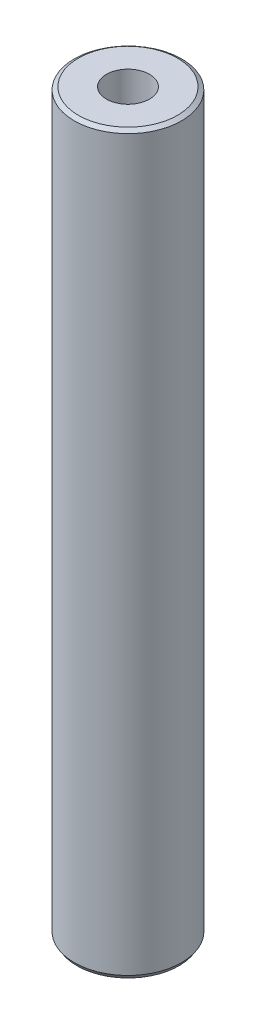
ISO-10303-21;
HEADER;
FILE_DESCRIPTION(('STEP AP214'),'2;1');
FILE_NAME('part.step','',(''),(''),'','','');
FILE_SCHEMA(('AUTOMOTIVE_DESIGN { 1 0 10303 214 1 1 1 1 }'));
ENDSEC;
DATA;
#1=APPLICATION_CONTEXT('core data for automotive mechanical design processes');
#2=APPLICATION_PROTOCOL_DEFINITION('international standard','automotive_design',2000,#1);
#3=PRODUCT_CONTEXT('',#1,'mechanical');
#4=PRODUCT('Part','Part','',(#3));
#5=PRODUCT_RELATED_PRODUCT_CATEGORY('part','',(#4));
#6=PRODUCT_DEFINITION_FORMATION('','',#4);
#7=PRODUCT_DEFINITION_CONTEXT('part definition',#1,'design');
#8=PRODUCT_DEFINITION('design','',#6,#7);
#9=PRODUCT_DEFINITION_SHAPE('','',#8);
#10=(LENGTH_UNIT() NAMED_UNIT(*) SI_UNIT(.MILLI.,.METRE.));
#11=(NAMED_UNIT(*) PLANE_ANGLE_UNIT() SI_UNIT($,.RADIAN.));
#12=(NAMED_UNIT(*) SI_UNIT($,.STERADIAN.) SOLID_ANGLE_UNIT());
#13=UNCERTAINTY_MEASURE_WITH_UNIT(LENGTH_MEASURE(1.E-05),#10,'distance_accuracy_value','');
#14=(GEOMETRIC_REPRESENTATION_CONTEXT(3) GLOBAL_UNCERTAINTY_ASSIGNED_CONTEXT((#13)) GLOBAL_UNIT_ASSIGNED_CONTEXT((#10,
#11,#12)) REPRESENTATION_CONTEXT('',''));
#15=CARTESIAN_POINT('',(0.,0.,0.));
#16=DIRECTION('',(0.,0.,1.));
#17=DIRECTION('',(1.,0.,0.));
#18=AXIS2_PLACEMENT_3D('',#15,#16,#17);
#19=CARTESIAN_POINT('',(0.,548.262568205207,0.));
#20=DIRECTION('',(0.,-1.,0.));
#21=DIRECTION('',(0.,0.,-1.));
#22=AXIS2_PLACEMENT_3D('',#19,#20,#21);
#23=CYLINDRICAL_SURFACE('',#22,40.);
#24=CARTESIAN_POINT('',(0.,546.249589709575,0.));
#25=DIRECTION('',(0.,1.,0.));
#26=DIRECTION('',(0.,0.,1.));
#27=AXIS2_PLACEMENT_3D('',#24,#25,#26);
#28=CIRCLE('',#27,40.);
#29=CARTESIAN_POINT('',(0.,546.249589709575,40.));
#30=VERTEX_POINT('',#29);
#31=EDGE_CURVE('E50',#30,#30,#28,.F.);
#32=ORIENTED_EDGE('',*,*,#31,.T.);
#33=EDGE_LOOP('',(#32));
#34=FACE_BOUND('',#33,.T.);
#35=CARTESIAN_POINT('',(0.,3.06563132807924,0.));
#36=DIRECTION('',(0.,1.,0.));
#37=DIRECTION('',(0.,0.,1.));
#38=AXIS2_PLACEMENT_3D('',#35,#36,#37);
#39=CIRCLE('',#38,40.);
#40=CARTESIAN_POINT('',(0.,3.06563132807924,40.));
#41=VERTEX_POINT('',#40);
#42=EDGE_CURVE('E51',#41,#41,#39,.T.);
#43=ORIENTED_EDGE('',*,*,#42,.T.);
#44=EDGE_LOOP('',(#43));
#45=FACE_BOUND('',#44,.T.);
#46=ADVANCED_FACE('F39',(#34,#45),#23,.T.);
#47=CARTESIAN_POINT('',(0.,548.262568205207,0.));
#48=DIRECTION('',(0.,1.,0.));
#49=DIRECTION('',(0.,0.,1.));
#50=AXIS2_PLACEMENT_3D('',#47,#48,#49);
#51=PLANE('',#50);
#52=CARTESIAN_POINT('',(0.,548.262568205207,0.));
#53=DIRECTION('',(0.,1.,0.));
#54=DIRECTION('',(0.,0.,1.));
#55=AXIS2_PLACEMENT_3D('',#52,#53,#54);
#56=CIRCLE('',#55,36.9343686719209);
#57=CARTESIAN_POINT('',(0.,548.262568205207,36.9343686719209));
#58=VERTEX_POINT('',#57);
#59=EDGE_CURVE('E54',#58,#58,#56,.T.);
#60=ORIENTED_EDGE('',*,*,#59,.T.);
#61=EDGE_LOOP('',(#60));
#62=FACE_BOUND('',#61,.T.);
#63=CARTESIAN_POINT('',(0.,548.262568205207,0.));
#64=DIRECTION('',(0.,1.,0.));
#65=DIRECTION('',(0.,0.,1.));
#66=AXIS2_PLACEMENT_3D('',#63,#64,#65);
#67=CIRCLE('',#66,16.0517247092455);
#68=CARTESIAN_POINT('',(0.,548.262568205207,16.0517247092455));
#69=VERTEX_POINT('',#68);
#70=EDGE_CURVE('E58',#69,#69,#67,.T.);
#71=ORIENTED_EDGE('',*,*,#70,.F.);
#72=EDGE_LOOP('',(#71));
#73=FACE_BOUND('',#72,.T.);
#74=ADVANCED_FACE('F69',(#62,#73),#51,.T.);
#75=CARTESIAN_POINT('',(0.,0.,0.));
#76=DIRECTION('',(0.,1.,0.));
#77=DIRECTION('',(0.,0.,1.));
#78=AXIS2_PLACEMENT_3D('',#75,#76,#77);
#79=PLANE('',#78);
#80=CARTESIAN_POINT('',(0.,0.,0.));
#81=DIRECTION('',(0.,1.,0.));
#82=DIRECTION('',(0.,0.,1.));
#83=AXIS2_PLACEMENT_3D('',#80,#81,#82);
#84=CIRCLE('',#83,37.9870215043677);
#85=CARTESIAN_POINT('',(0.,0.,37.9870215043677));
#86=VERTEX_POINT('',#85);
#87=EDGE_CURVE('E10',#86,#86,#84,.F.);
#88=ORIENTED_EDGE('',*,*,#87,.T.);
#89=EDGE_LOOP('',(#88));
#90=FACE_BOUND('',#89,.T.);
#91=CARTESIAN_POINT('',(0.,0.,0.));
#92=DIRECTION('',(0.,1.,0.));
#93=DIRECTION('',(0.,0.,1.));
#94=AXIS2_PLACEMENT_3D('',#91,#92,#93);
#95=CIRCLE('',#94,16.0517247092455);
#96=CARTESIAN_POINT('',(0.,0.,16.0517247092455));
#97=VERTEX_POINT('',#96);
#98=EDGE_CURVE('E63',#97,#97,#95,.T.);
#99=ORIENTED_EDGE('',*,*,#98,.T.);
#100=EDGE_LOOP('',(#99));
#101=FACE_BOUND('',#100,.T.);
#102=ADVANCED_FACE('F75',(#90,#101),#79,.F.);
#103=CARTESIAN_POINT('',(0.,548.262568205207,0.));
#104=DIRECTION('',(0.,-1.,0.));
#105=DIRECTION('',(0.,0.,-1.));
#106=AXIS2_PLACEMENT_3D('',#103,#104,#105);
#107=CYLINDRICAL_SURFACE('',#106,16.0517247092455);
#108=ORIENTED_EDGE('',*,*,#70,.T.);
#109=EDGE_LOOP('',(#108));
#110=FACE_BOUND('',#109,.T.);
#111=ORIENTED_EDGE('',*,*,#98,.F.);
#112=EDGE_LOOP('',(#111));
#113=FACE_BOUND('',#112,.T.);
#114=ADVANCED_FACE('F70',(#110,#113),#107,.F.);
#115=CARTESIAN_POINT('',(0.,548.262568205207,0.));
#116=DIRECTION('',(0.,-1.,0.));
#117=DIRECTION('',(0.,0.,-1.));
#118=AXIS2_PLACEMENT_3D('',#115,#116,#117);
#119=CONICAL_SURFACE('',#118,36.9343686719209,0.989776004832556);
#120=ORIENTED_EDGE('',*,*,#31,.F.);
#121=EDGE_LOOP('',(#120));
#122=FACE_BOUND('',#121,.T.);
#123=ORIENTED_EDGE('',*,*,#59,.F.);
#124=EDGE_LOOP('',(#123));
#125=FACE_BOUND('',#124,.T.);
#126=ADVANCED_FACE('F81',(#122,#125),#119,.T.);
#127=CARTESIAN_POINT('',(0.,3.06563132807924,0.));
#128=DIRECTION('',(0.,1.,0.));
#129=DIRECTION('',(0.,0.,1.));
#130=AXIS2_PLACEMENT_3D('',#127,#128,#129);
#131=CONICAL_SURFACE('',#130,40.,0.581020321962311);
#132=CARTESIAN_POINT('',(0.,0.,37.9870215043677));
#133=CARTESIAN_POINT('',(0.,0.0319336596674932,38.0079900303639));
#134=CARTESIAN_POINT('',(0.,0.0638673193349848,38.0289585563601));
#135=CARTESIAN_POINT('',(0.,0.127734638669968,38.0708956083524));
#136=CARTESIAN_POINT('',(0.,0.15966829833746,38.0918641343486));
#137=CARTESIAN_POINT('',(0.,0.223535617672444,38.1338011863409));
#138=CARTESIAN_POINT('',(0.,0.255469277339936,38.1547697123371));
#139=CARTESIAN_POINT('',(0.,0.319336596674921,38.1967067643294));
#140=CARTESIAN_POINT('',(0.,0.351270256342414,38.2176752903256));
#141=CARTESIAN_POINT('',(0.,0.415137575677397,38.2596123423179));
#142=CARTESIAN_POINT('',(0.,0.447071235344889,38.2805808683141));
#143=CARTESIAN_POINT('',(0.,0.510938554679873,38.3225179203064));
#144=CARTESIAN_POINT('',(0.,0.542872214347365,38.3434864463026));
#145=CARTESIAN_POINT('',(0.,0.60673953368235,38.3854234982949));
#146=CARTESIAN_POINT('',(0.,0.638673193349843,38.4063920242911));
#147=CARTESIAN_POINT('',(0.,0.702540512684827,38.4483290762835));
#148=CARTESIAN_POINT('',(0.,0.734474172352318,38.4692976022796));
#149=CARTESIAN_POINT('',(0.,0.798341491687302,38.511234654272));
#150=CARTESIAN_POINT('',(0.,0.830275151354794,38.5322031802681));
#151=CARTESIAN_POINT('',(0.,0.894142470689779,38.5741402322605));
#152=CARTESIAN_POINT('',(0.,0.926076130357272,38.5951087582566));
#153=CARTESIAN_POINT('',(0.,0.989943449692256,38.637045810249));
#154=CARTESIAN_POINT('',(0.,1.02187710935975,38.6580143362451));
#155=CARTESIAN_POINT('',(0.,1.08574442869473,38.6999513882375));
#156=CARTESIAN_POINT('',(0.,1.11767808836222,38.7209199142337));
#157=CARTESIAN_POINT('',(0.,1.18154540769721,38.762856966226));
#158=CARTESIAN_POINT('',(0.,1.2134790673647,38.7838254922222));
#159=CARTESIAN_POINT('',(0.,1.27734638669969,38.8257625442145));
#160=CARTESIAN_POINT('',(0.,1.30928004636718,38.8467310702107));
#161=CARTESIAN_POINT('',(0.,1.37314736570216,38.888668122203));
#162=CARTESIAN_POINT('',(0.,1.40508102536965,38.9096366481992));
#163=CARTESIAN_POINT('',(0.,1.46894834470464,38.9515737001915));
#164=CARTESIAN_POINT('',(0.,1.50088200437213,38.9725422261877));
#165=CARTESIAN_POINT('',(0.,1.56474932370711,39.01447927818));
#166=CARTESIAN_POINT('',(0.,1.59668298337461,39.0354478041762));
#167=CARTESIAN_POINT('',(0.,1.66055030270959,39.0773848561685));
#168=CARTESIAN_POINT('',(0.,1.69248396237708,39.0983533821647));
#169=CARTESIAN_POINT('',(0.,1.75635128171207,39.140290434157));
#170=CARTESIAN_POINT('',(0.,1.78828494137956,39.1612589601532));
#171=CARTESIAN_POINT('',(0.,1.85215226071454,39.2031960121456));
#172=CARTESIAN_POINT('',(0.,1.88408592038203,39.2241645381417));
#173=CARTESIAN_POINT('',(0.,1.94795323971702,39.2661015901341));
#174=CARTESIAN_POINT('',(0.,1.97988689938451,39.2870701161302));
#175=CARTESIAN_POINT('',(0.,2.0437542187195,39.3290071681226));
#176=CARTESIAN_POINT('',(0.,2.07568787838699,39.3499756941187));
#177=CARTESIAN_POINT('',(0.,2.13955519772197,39.3919127461111));
#178=CARTESIAN_POINT('',(0.,2.17148885738946,39.4128812721073));
#179=CARTESIAN_POINT('',(0.,2.23535617672445,39.4548183240996));
#180=CARTESIAN_POINT('',(0.,2.26728983639194,39.4757868500958));
#181=CARTESIAN_POINT('',(0.,2.33115715572693,39.5177239020881));
#182=CARTESIAN_POINT('',(0.,2.36309081539442,39.5386924280843));
#183=CARTESIAN_POINT('',(0.,2.4269581347294,39.5806294800766));
#184=CARTESIAN_POINT('',(0.,2.45889179439689,39.6015980060728));
#185=CARTESIAN_POINT('',(0.,2.52275911373188,39.6435350580651));
#186=CARTESIAN_POINT('',(0.,2.55469277339937,39.6645035840613));
#187=CARTESIAN_POINT('',(0.,2.61856009273435,39.7064406360536));
#188=CARTESIAN_POINT('',(0.,2.65049375240185,39.7274091620498));
#189=CARTESIAN_POINT('',(0.,2.71436107173683,39.7693462140421));
#190=CARTESIAN_POINT('',(0.,2.74629473140432,39.7903147400383));
#191=CARTESIAN_POINT('',(0.,2.81016205073931,39.8322517920306));
#192=CARTESIAN_POINT('',(0.,2.8420957104068,39.8532203180268));
#193=CARTESIAN_POINT('',(0.,2.90596302974178,39.8951573700192));
#194=CARTESIAN_POINT('',(0.,2.93789668940927,39.9161258960153));
#195=CARTESIAN_POINT('',(0.,3.00176400874426,39.9580629480077));
#196=CARTESIAN_POINT('',(0.,3.03369766841175,39.9790314740038));
#197=CARTESIAN_POINT('',(0.,3.06563132807924,40.));
#198=B_SPLINE_CURVE_WITH_KNOTS('',3,(#132,#133,#134,#135,#136,#137,#138,#139,#140,#141,#142,
#143,#144,#145,#146,#147,#148,#149,#150,#151,#152,#153,#154,#155,#156,#157,#158,#159,#160,#161,
#162,#163,#164,#165,#166,#167,#168,#169,#170,#171,#172,#173,#174,#175,#176,#177,#178,#179,#180,
#181,#182,#183,#184,#185,#186,#187,#188,#189,#190,#191,#192,#193,#194,#195,#196,#197),
.UNSPECIFIED.,.F.,.F.,(4,2,2,2,2,2,2,2,2,2,2,2,2,2,2,2,2,2,2,2,2,2,2,2,2,2,2,2,2,2,2,2,4),(0.,
0.114607762912906,0.229215525825817,0.343823288738723,0.458431051651629,0.57303881456454,
0.687646577477446,0.802254340390352,0.916862103303263,1.03146986621617,1.14607762912908,
1.26068539204199,1.37529315495489,1.4899009178678,1.60450868078071,1.71911644369362,
1.83372420660652,1.94833196951943,2.06293973243234,2.17754749534524,2.29215525825815,
2.40676302117106,2.52137078408397,2.63597854699688,2.75058630990978,2.86519407282269,
2.9798018357356,3.09440959864851,3.20901736156142,3.32362512447432,3.43823288738723,
3.55284065030014,3.66744841321305),.UNSPECIFIED.);
#199=EDGE_CURVE('BSEAM45',#86,#41,#198,.T.);
#200=ORIENTED_EDGE('',*,*,#87,.F.);
#201=ORIENTED_EDGE('',*,*,#42,.F.);
#202=ORIENTED_EDGE('',*,*,#199,.T.);
#203=ORIENTED_EDGE('',*,*,#199,.F.);
#204=EDGE_LOOP('',(#200,#202,#201,#203));
#205=FACE_BOUND('',#204,.T.);
#206=ADVANCED_FACE('F45',(#205),#131,.T.);
#207=CLOSED_SHELL('',(#46,#74,#102,#114,#126,#206));
#208=MANIFOLD_SOLID_BREP('B2',#207);
#209=ADVANCED_BREP_SHAPE_REPRESENTATION('',(#18,#208),#14);
#210=SHAPE_DEFINITION_REPRESENTATION(#9,#209);
ENDSEC;
END-ISO-10303-21;
